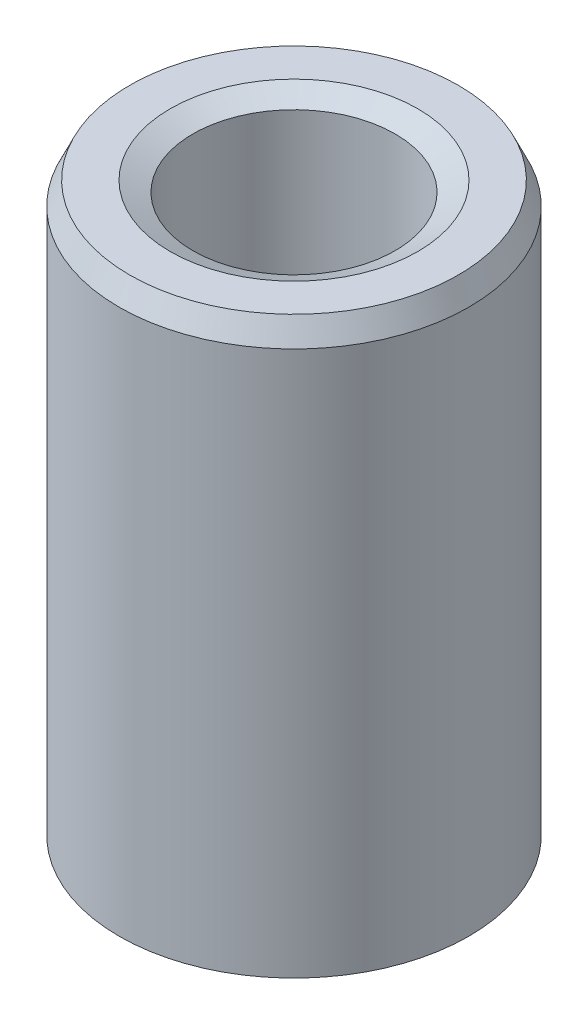
ISO-10303-21;
HEADER;
FILE_DESCRIPTION(('STEP AP214'),'2;1');
FILE_NAME('part.step','',(''),(''),'','','');
FILE_SCHEMA(('AUTOMOTIVE_DESIGN { 1 0 10303 214 1 1 1 1 }'));
ENDSEC;
DATA;
#1=APPLICATION_CONTEXT('core data for automotive mechanical design processes');
#2=APPLICATION_PROTOCOL_DEFINITION('international standard','automotive_design',2000,#1);
#3=PRODUCT_CONTEXT('',#1,'mechanical');
#4=PRODUCT('Part','Part','',(#3));
#5=PRODUCT_RELATED_PRODUCT_CATEGORY('part','',(#4));
#6=PRODUCT_DEFINITION_FORMATION('','',#4);
#7=PRODUCT_DEFINITION_CONTEXT('part definition',#1,'design');
#8=PRODUCT_DEFINITION('design','',#6,#7);
#9=PRODUCT_DEFINITION_SHAPE('','',#8);
#10=(LENGTH_UNIT() NAMED_UNIT(*) SI_UNIT(.MILLI.,.METRE.));
#11=(NAMED_UNIT(*) PLANE_ANGLE_UNIT() SI_UNIT($,.RADIAN.));
#12=(NAMED_UNIT(*) SI_UNIT($,.STERADIAN.) SOLID_ANGLE_UNIT());
#13=UNCERTAINTY_MEASURE_WITH_UNIT(LENGTH_MEASURE(1.E-05),#10,'distance_accuracy_value','');
#14=(GEOMETRIC_REPRESENTATION_CONTEXT(3) GLOBAL_UNCERTAINTY_ASSIGNED_CONTEXT((#13)) GLOBAL_UNIT_ASSIGNED_CONTEXT((#10,
#11,#12)) REPRESENTATION_CONTEXT('',''));
#15=CARTESIAN_POINT('',(0.,0.,0.));
#16=DIRECTION('',(0.,0.,1.));
#17=DIRECTION('',(1.,0.,0.));
#18=AXIS2_PLACEMENT_3D('',#15,#16,#17);
#19=CARTESIAN_POINT('',(0.,24.7899167804322,0.));
#20=DIRECTION('',(0.,-1.,0.));
#21=DIRECTION('',(0.,0.,-1.));
#22=AXIS2_PLACEMENT_3D('',#19,#20,#21);
#23=CYLINDRICAL_SURFACE('',#22,7.5);
#24=CARTESIAN_POINT('',(0.,0.45156439753824,0.));
#25=DIRECTION('',(0.,1.,0.));
#26=DIRECTION('',(0.,0.,1.));
#27=AXIS2_PLACEMENT_3D('',#24,#25,#26);
#28=CIRCLE('',#27,7.5);
#29=CARTESIAN_POINT('',(0.,0.45156439753824,7.5));
#30=VERTEX_POINT('',#29);
#31=EDGE_CURVE('E10',#30,#30,#28,.T.);
#32=ORIENTED_EDGE('',*,*,#31,.T.);
#33=EDGE_LOOP('',(#32));
#34=FACE_BOUND('',#33,.T.);
#35=CARTESIAN_POINT('',(0.,23.8208821005237,0.));
#36=DIRECTION('',(0.,1.,0.));
#37=DIRECTION('',(0.,0.,1.));
#38=AXIS2_PLACEMENT_3D('',#35,#36,#37);
#39=CIRCLE('',#38,7.5);
#40=CARTESIAN_POINT('',(0.,23.8208821005237,7.5));
#41=VERTEX_POINT('',#40);
#42=EDGE_CURVE('E50',#41,#41,#39,.F.);
#43=ORIENTED_EDGE('',*,*,#42,.T.);
#44=EDGE_LOOP('',(#43));
#45=FACE_BOUND('',#44,.T.);
#46=ADVANCED_FACE('F39',(#34,#45),#23,.T.);
#47=CARTESIAN_POINT('',(0.,24.7899167804322,0.));
#48=DIRECTION('',(0.,1.,0.));
#49=DIRECTION('',(0.,0.,1.));
#50=AXIS2_PLACEMENT_3D('',#47,#48,#49);
#51=PLANE('',#50);
#52=CARTESIAN_POINT('',(0.,24.7899167804322,0.));
#53=DIRECTION('',(0.,1.,0.));
#54=DIRECTION('',(0.,0.,1.));
#55=AXIS2_PLACEMENT_3D('',#52,#53,#54);
#56=CIRCLE('',#55,5.30854487067612);
#57=CARTESIAN_POINT('',(0.,24.7899167804322,5.30854487067612));
#58=VERTEX_POINT('',#57);
#59=EDGE_CURVE('E58',#58,#58,#56,.F.);
#60=ORIENTED_EDGE('',*,*,#59,.T.);
#61=EDGE_LOOP('',(#60));
#62=FACE_BOUND('',#61,.T.);
#63=CARTESIAN_POINT('',(0.,24.7899167804322,0.));
#64=DIRECTION('',(0.,1.,0.));
#65=DIRECTION('',(0.,0.,1.));
#66=AXIS2_PLACEMENT_3D('',#63,#64,#65);
#67=CIRCLE('',#66,7.04843560246177);
#68=CARTESIAN_POINT('',(0.,24.7899167804322,7.04843560246177));
#69=VERTEX_POINT('',#68);
#70=EDGE_CURVE('E61',#69,#69,#67,.T.);
#71=ORIENTED_EDGE('',*,*,#70,.T.);
#72=EDGE_LOOP('',(#71));
#73=FACE_BOUND('',#72,.T.);
#74=ADVANCED_FACE('F88',(#62,#73),#51,.T.);
#75=CARTESIAN_POINT('',(0.,0.,0.));
#76=DIRECTION('',(0.,1.,0.));
#77=DIRECTION('',(0.,0.,1.));
#78=AXIS2_PLACEMENT_3D('',#75,#76,#77);
#79=PLANE('',#78);
#80=CARTESIAN_POINT('',(0.,0.,0.));
#81=DIRECTION('',(0.,1.,0.));
#82=DIRECTION('',(0.,0.,1.));
#83=AXIS2_PLACEMENT_3D('',#80,#81,#82);
#84=CIRCLE('',#83,4.79107458830587);
#85=CARTESIAN_POINT('',(0.,0.,-4.79107458830587));
#86=VERTEX_POINT('',#85);
#87=EDGE_CURVE('E51',#86,#86,#84,.T.);
#88=ORIENTED_EDGE('',*,*,#87,.T.);
#89=EDGE_LOOP('',(#88));
#90=FACE_BOUND('',#89,.T.);
#91=CARTESIAN_POINT('',(0.,0.,0.));
#92=DIRECTION('',(0.,1.,0.));
#93=DIRECTION('',(0.,0.,1.));
#94=AXIS2_PLACEMENT_3D('',#91,#92,#93);
#95=CIRCLE('',#94,6.5309653200915);
#96=CARTESIAN_POINT('',(0.,0.,6.5309653200915));
#97=VERTEX_POINT('',#96);
#98=EDGE_CURVE('E54',#97,#97,#95,.F.);
#99=ORIENTED_EDGE('',*,*,#98,.T.);
#100=EDGE_LOOP('',(#99));
#101=FACE_BOUND('',#100,.T.);
#102=ADVANCED_FACE('F83',(#90,#101),#79,.F.);
#103=CARTESIAN_POINT('',(0.,24.7899167804322,0.));
#104=DIRECTION('',(0.,-1.,0.));
#105=DIRECTION('',(0.,0.,-1.));
#106=AXIS2_PLACEMENT_3D('',#103,#104,#105);
#107=CYLINDRICAL_SURFACE('',#106,4.33951019076763);
#108=CARTESIAN_POINT('',(0.,24.3383523828939,0.));
#109=DIRECTION('',(0.,1.,0.));
#110=DIRECTION('',(0.,0.,1.));
#111=AXIS2_PLACEMENT_3D('',#108,#109,#110);
#112=CIRCLE('',#111,4.33951019076763);
#113=CARTESIAN_POINT('',(0.,24.3383523828939,4.33951019076763));
#114=VERTEX_POINT('',#113);
#115=EDGE_CURVE('E67',#114,#114,#112,.T.);
#116=ORIENTED_EDGE('',*,*,#115,.T.);
#117=EDGE_LOOP('',(#116));
#118=FACE_BOUND('',#117,.T.);
#119=CARTESIAN_POINT('',(0.,0.969034679908509,0.));
#120=DIRECTION('',(0.,1.,0.));
#121=DIRECTION('',(0.,0.,1.));
#122=AXIS2_PLACEMENT_3D('',#119,#120,#121);
#123=CIRCLE('',#122,4.33951019076763);
#124=CARTESIAN_POINT('',(0.,0.969034679908508,-4.33951019076763));
#125=VERTEX_POINT('',#124);
#126=EDGE_CURVE('E69',#125,#125,#123,.F.);
#127=ORIENTED_EDGE('',*,*,#126,.T.);
#128=EDGE_LOOP('',(#127));
#129=FACE_BOUND('',#128,.T.);
#130=ADVANCED_FACE('F71',(#118,#129),#107,.F.);
#131=CARTESIAN_POINT('',(0.,24.3383523828939,0.));
#132=DIRECTION('',(0.,1.,0.));
#133=DIRECTION('',(0.,0.,1.));
#134=AXIS2_PLACEMENT_3D('',#131,#132,#133);
#135=CONICAL_SURFACE('',#134,4.33951019076763,1.13472163844877);
#136=ORIENTED_EDGE('',*,*,#59,.F.);
#137=EDGE_LOOP('',(#136));
#138=FACE_BOUND('',#137,.T.);
#139=ORIENTED_EDGE('',*,*,#115,.F.);
#140=EDGE_LOOP('',(#139));
#141=FACE_BOUND('',#140,.T.);
#142=ADVANCED_FACE('F77',(#138,#141),#135,.F.);
#143=CARTESIAN_POINT('',(0.,0.,0.));
#144=DIRECTION('',(0.,-1.,0.));
#145=DIRECTION('',(0.,0.,-1.));
#146=AXIS2_PLACEMENT_3D('',#143,#144,#145);
#147=CONICAL_SURFACE('',#146,4.79107458830587,0.436074688346122);
#148=CARTESIAN_POINT('',(0.,0.969034679908508,-4.33951019076763));
#149=CARTESIAN_POINT('',(0.,0.958940568659461,-4.34421398657532));
#150=CARTESIAN_POINT('',(0.,0.948846457410415,-4.34891778238301));
#151=CARTESIAN_POINT('',(0.,0.928658234912321,-4.35832537399839));
#152=CARTESIAN_POINT('',(0.,0.918564123663274,-4.36302916980608));
#153=CARTESIAN_POINT('',(0.,0.89837590116518,-4.37243676142146));
#154=CARTESIAN_POINT('',(0.,0.888281789916133,-4.37714055722915));
#155=CARTESIAN_POINT('',(0.,0.868093567418039,-4.38654814884453));
#156=CARTESIAN_POINT('',(0.,0.857999456168992,-4.39125194465222));
#157=CARTESIAN_POINT('',(0.,0.837811233670898,-4.4006595362676));
#158=CARTESIAN_POINT('',(0.,0.827717122421851,-4.40536333207529));
#159=CARTESIAN_POINT('',(0.,0.807528899923757,-4.41477092369067));
#160=CARTESIAN_POINT('',(0.,0.79743478867471,-4.41947471949836));
#161=CARTESIAN_POINT('',(0.,0.777246566176616,-4.42888231111374));
#162=CARTESIAN_POINT('',(0.,0.767152454927569,-4.43358610692143));
#163=CARTESIAN_POINT('',(0.,0.746964232429475,-4.44299369853681));
#164=CARTESIAN_POINT('',(0.,0.736870121180428,-4.4476974943445));
#165=CARTESIAN_POINT('',(0.,0.716681898682334,-4.45710508595988));
#166=CARTESIAN_POINT('',(0.,0.706587787433287,-4.46180888176757));
#167=CARTESIAN_POINT('',(0.,0.686399564935193,-4.47121647338295));
#168=CARTESIAN_POINT('',(0.,0.676305453686146,-4.47592026919064));
#169=CARTESIAN_POINT('',(0.,0.656117231188053,-4.48532786080602));
#170=CARTESIAN_POINT('',(0.,0.646023119939006,-4.49003165661371));
#171=CARTESIAN_POINT('',(0.,0.625834897440912,-4.49943924822909));
#172=CARTESIAN_POINT('',(0.,0.615740786191865,-4.50414304403678));
#173=CARTESIAN_POINT('',(0.,0.595552563693771,-4.51355063565216));
#174=CARTESIAN_POINT('',(0.,0.585458452444724,-4.51825443145985));
#175=CARTESIAN_POINT('',(0.,0.56527022994663,-4.52766202307523));
#176=CARTESIAN_POINT('',(0.,0.555176118697583,-4.53236581888292));
#177=CARTESIAN_POINT('',(0.,0.534987896199489,-4.5417734104983));
#178=CARTESIAN_POINT('',(0.,0.524893784950442,-4.54647720630599));
#179=CARTESIAN_POINT('',(0.,0.504705562452348,-4.55588479792137));
#180=CARTESIAN_POINT('',(0.,0.494611451203301,-4.56058859372906));
#181=CARTESIAN_POINT('',(0.,0.474423228705207,-4.56999618534444));
#182=CARTESIAN_POINT('',(0.,0.46432911745616,-4.57469998115213));
#183=CARTESIAN_POINT('',(0.,0.444140894958066,-4.58410757276751));
#184=CARTESIAN_POINT('',(0.,0.434046783709019,-4.5888113685752));
#185=CARTESIAN_POINT('',(0.,0.413858561210925,-4.59821896019058));
#186=CARTESIAN_POINT('',(0.,0.403764449961878,-4.60292275599827));
#187=CARTESIAN_POINT('',(0.,0.383576227463785,-4.61233034761365));
#188=CARTESIAN_POINT('',(0.,0.373482116214738,-4.61703414342134));
#189=CARTESIAN_POINT('',(0.,0.353293893716644,-4.62644173503672));
#190=CARTESIAN_POINT('',(0.,0.343199782467597,-4.63114553084441));
#191=CARTESIAN_POINT('',(0.,0.323011559969503,-4.64055312245979));
#192=CARTESIAN_POINT('',(0.,0.312917448720456,-4.64525691826748));
#193=CARTESIAN_POINT('',(0.,0.292729226222362,-4.65466450988286));
#194=CARTESIAN_POINT('',(0.,0.282635114973315,-4.65936830569055));
#195=CARTESIAN_POINT('',(0.,0.262446892475221,-4.66877589730593));
#196=CARTESIAN_POINT('',(0.,0.252352781226174,-4.67347969311362));
#197=CARTESIAN_POINT('',(0.,0.23216455872808,-4.682887284729));
#198=CARTESIAN_POINT('',(0.,0.222070447479033,-4.68759108053669));
#199=CARTESIAN_POINT('',(0.,0.201882224980939,-4.69699867215207));
#200=CARTESIAN_POINT('',(0.,0.191788113731892,-4.70170246795976));
#201=CARTESIAN_POINT('',(0.,0.171599891233798,-4.71111005957514));
#202=CARTESIAN_POINT('',(0.,0.161505779984751,-4.71581385538283));
#203=CARTESIAN_POINT('',(0.,0.141317557486657,-4.72522144699821));
#204=CARTESIAN_POINT('',(0.,0.131223446237611,-4.7299252428059));
#205=CARTESIAN_POINT('',(0.,0.111035223739517,-4.73933283442128));
#206=CARTESIAN_POINT('',(0.,0.10094111249047,-4.74403663022897));
#207=CARTESIAN_POINT('',(0.,0.0807528899923757,-4.75344422184435));
#208=CARTESIAN_POINT('',(0.,0.0706587787433287,-4.75814801765204));
#209=CARTESIAN_POINT('',(0.,0.0504705562452348,-4.76755560926742));
#210=CARTESIAN_POINT('',(0.,0.0403764449961879,-4.77225940507511));
#211=CARTESIAN_POINT('',(0.,0.0201882224980939,-4.78166699669049));
#212=CARTESIAN_POINT('',(0.,0.010094111249047,-4.78637079249818));
#213=CARTESIAN_POINT('',(0.,0.,-4.79107458830587));
#214=B_SPLINE_CURVE_WITH_KNOTS('',3,(#148,#149,#150,#151,#152,#153,#154,#155,#156,#157,#158,
#159,#160,#161,#162,#163,#164,#165,#166,#167,#168,#169,#170,#171,#172,#173,#174,#175,#176,#177,
#178,#179,#180,#181,#182,#183,#184,#185,#186,#187,#188,#189,#190,#191,#192,#193,#194,#195,#196,
#197,#198,#199,#200,#201,#202,#203,#204,#205,#206,#207,#208,#209,#210,#211,#212,#213),
.UNSPECIFIED.,.F.,.F.,(4,2,2,2,2,2,2,2,2,2,2,2,2,2,2,2,2,2,2,2,2,2,2,2,2,2,2,2,2,2,2,2,4),(0.,
0.0334088460168442,0.0668176920336884,0.100226538050533,0.133635384067377,0.167044230084221,
0.200453076101065,0.233861922117909,0.267270768134754,0.300679614151598,0.334088460168442,
0.367497306185286,0.40090615220213,0.434314998218975,0.467723844235819,0.501132690252663,
0.534541536269508,0.567950382286352,0.601359228303196,0.63476807432004,0.668176920336884,
0.701585766353729,0.734994612370573,0.768403458387417,0.801812304404261,0.835221150421106,
0.86862999643795,0.902038842454794,0.935447688471638,0.968856534488482,1.00226538050533,
1.03567422652217,1.06908307253901),.UNSPECIFIED.);
#215=EDGE_CURVE('BSEAM73',#125,#86,#214,.T.);
#216=ORIENTED_EDGE('',*,*,#126,.F.);
#217=ORIENTED_EDGE('',*,*,#87,.F.);
#218=ORIENTED_EDGE('',*,*,#215,.T.);
#219=ORIENTED_EDGE('',*,*,#215,.F.);
#220=EDGE_LOOP('',(#216,#218,#217,#219));
#221=FACE_BOUND('',#220,.T.);
#222=ADVANCED_FACE('F73',(#221),#147,.F.);
#223=CARTESIAN_POINT('',(0.,0.45156439753824,0.));
#224=DIRECTION('',(0.,1.,0.));
#225=DIRECTION('',(0.,0.,1.));
#226=AXIS2_PLACEMENT_3D('',#223,#224,#225);
#227=CONICAL_SURFACE('',#226,7.5,1.13472163844877);
#228=ORIENTED_EDGE('',*,*,#98,.F.);
#229=EDGE_LOOP('',(#228));
#230=FACE_BOUND('',#229,.T.);
#231=ORIENTED_EDGE('',*,*,#31,.F.);
#232=EDGE_LOOP('',(#231));
#233=FACE_BOUND('',#232,.T.);
#234=ADVANCED_FACE('F76',(#230,#233),#227,.T.);
#235=CARTESIAN_POINT('',(0.,24.7899167804322,0.));
#236=DIRECTION('',(0.,-1.,0.));
#237=DIRECTION('',(0.,0.,-1.));
#238=AXIS2_PLACEMENT_3D('',#235,#236,#237);
#239=CONICAL_SURFACE('',#238,7.04843560246177,0.436074688346125);
#240=ORIENTED_EDGE('',*,*,#42,.F.);
#241=EDGE_LOOP('',(#240));
#242=FACE_BOUND('',#241,.T.);
#243=ORIENTED_EDGE('',*,*,#70,.F.);
#244=EDGE_LOOP('',(#243));
#245=FACE_BOUND('',#244,.T.);
#246=ADVANCED_FACE('F45',(#242,#245),#239,.T.);
#247=CLOSED_SHELL('',(#46,#74,#102,#130,#142,#222,#234,#246));
#248=MANIFOLD_SOLID_BREP('B2',#247);
#249=ADVANCED_BREP_SHAPE_REPRESENTATION('',(#18,#248),#14);
#250=SHAPE_DEFINITION_REPRESENTATION(#9,#249);
ENDSEC;
END-ISO-10303-21;
